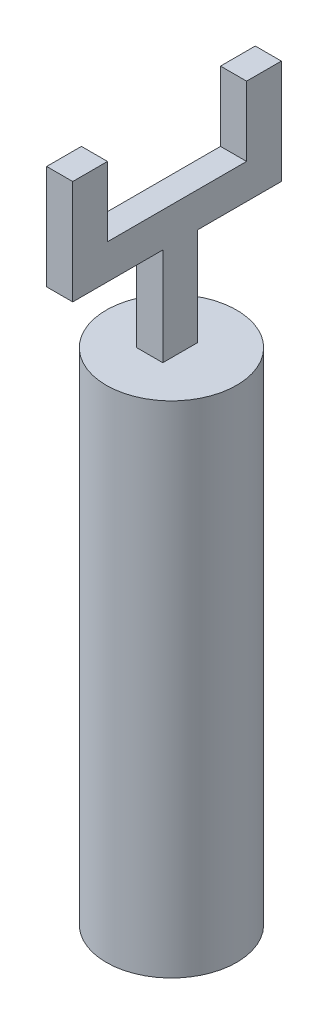
ISO-10303-21;
HEADER;
FILE_DESCRIPTION(('STEP AP214'),'2;1');
FILE_NAME('part.step','',(''),(''),'','','');
FILE_SCHEMA(('AUTOMOTIVE_DESIGN { 1 0 10303 214 1 1 1 1 }'));
ENDSEC;
DATA;
#1=APPLICATION_CONTEXT('core data for automotive mechanical design processes');
#2=APPLICATION_PROTOCOL_DEFINITION('international standard','automotive_design',2000,#1);
#3=PRODUCT_CONTEXT('',#1,'mechanical');
#4=PRODUCT('Part','Part','',(#3));
#5=PRODUCT_RELATED_PRODUCT_CATEGORY('part','',(#4));
#6=PRODUCT_DEFINITION_FORMATION('','',#4);
#7=PRODUCT_DEFINITION_CONTEXT('part definition',#1,'design');
#8=PRODUCT_DEFINITION('design','',#6,#7);
#9=PRODUCT_DEFINITION_SHAPE('','',#8);
#10=(LENGTH_UNIT() NAMED_UNIT(*) SI_UNIT(.MILLI.,.METRE.));
#11=(NAMED_UNIT(*) PLANE_ANGLE_UNIT() SI_UNIT($,.RADIAN.));
#12=(NAMED_UNIT(*) SI_UNIT($,.STERADIAN.) SOLID_ANGLE_UNIT());
#13=UNCERTAINTY_MEASURE_WITH_UNIT(LENGTH_MEASURE(1.E-05),#10,'distance_accuracy_value','');
#14=(GEOMETRIC_REPRESENTATION_CONTEXT(3) GLOBAL_UNCERTAINTY_ASSIGNED_CONTEXT((#13)) GLOBAL_UNIT_ASSIGNED_CONTEXT((#10,
#11,#12)) REPRESENTATION_CONTEXT('',''));
#15=CARTESIAN_POINT('',(0.,0.,0.));
#16=DIRECTION('',(0.,0.,1.));
#17=DIRECTION('',(1.,0.,0.));
#18=AXIS2_PLACEMENT_3D('',#15,#16,#17);
#19=CARTESIAN_POINT('',(0.1,6.87337780073219,1.23598294434797));
#20=DIRECTION('',(0.,1.,0.));
#21=DIRECTION('',(0.,0.,1.));
#22=AXIS2_PLACEMENT_3D('',#19,#20,#21);
#23=PLANE('',#22);
#24=DIRECTION('',(0.,0.,-1.));
#25=VECTOR('',#24,1.);
#26=CARTESIAN_POINT('',(-0.2,6.87337780073219,1.23598294434797));
#27=LINE('',#26,#25);
#28=CARTESIAN_POINT('',(-0.2,6.87337780073219,1.23598294434797));
#29=VERTEX_POINT('',#28);
#30=CARTESIAN_POINT('',(-0.2,6.87337780073219,0.2));
#31=VERTEX_POINT('',#30);
#32=EDGE_CURVE('E242',#29,#31,#27,.T.);
#33=ORIENTED_EDGE('',*,*,#32,.T.);
#34=DIRECTION('',(1.,0.,0.));
#35=VECTOR('',#34,1.);
#36=CARTESIAN_POINT('',(-0.2,6.87337780073219,0.2));
#37=LINE('',#36,#35);
#38=CARTESIAN_POINT('',(0.1,6.87337780073219,0.2));
#39=VERTEX_POINT('',#38);
#40=EDGE_CURVE('E13',#31,#39,#37,.T.);
#41=ORIENTED_EDGE('',*,*,#40,.T.);
#42=DIRECTION('',(0.,0.,-1.));
#43=VECTOR('',#42,1.);
#44=CARTESIAN_POINT('',(0.1,6.87337780073219,1.23598294434797));
#45=LINE('',#44,#43);
#46=CARTESIAN_POINT('',(0.1,6.87337780073219,1.23598294434797));
#47=VERTEX_POINT('',#46);
#48=EDGE_CURVE('E263',#47,#39,#45,.T.);
#49=ORIENTED_EDGE('',*,*,#48,.F.);
#50=DIRECTION('',(-1.,0.,0.));
#51=VECTOR('',#50,1.);
#52=CARTESIAN_POINT('',(0.1,6.87337780073219,1.23598294434797));
#53=LINE('',#52,#51);
#54=EDGE_CURVE('E282',#47,#29,#53,.T.);
#55=ORIENTED_EDGE('',*,*,#54,.T.);
#56=EDGE_LOOP('',(#33,#41,#49,#55));
#57=FACE_BOUND('',#56,.T.);
#58=ADVANCED_FACE('F119',(#57),#23,.F.);
#59=CARTESIAN_POINT('',(0.1,0.,0.));
#60=DIRECTION('',(1.,0.,0.));
#61=DIRECTION('',(0.,0.,-1.));
#62=AXIS2_PLACEMENT_3D('',#59,#60,#61);
#63=PLANE('',#62);
#64=DIRECTION('',(0.,1.,0.));
#65=VECTOR('',#64,1.);
#66=CARTESIAN_POINT('',(0.1,0.,0.2));
#67=LINE('',#66,#65);
#68=CARTESIAN_POINT('',(0.1,5.69193779464038,0.2));
#69=VERTEX_POINT('',#68);
#70=EDGE_CURVE('E221',#69,#39,#67,.T.);
#71=ORIENTED_EDGE('',*,*,#70,.F.);
#72=DIRECTION('',(0.,0.,-1.));
#73=VECTOR('',#72,1.);
#74=CARTESIAN_POINT('',(0.1,5.69193779464038,0.));
#75=LINE('',#74,#73);
#76=CARTESIAN_POINT('',(0.1,5.69193779464038,-0.2));
#77=VERTEX_POINT('',#76);
#78=EDGE_CURVE('E289',#69,#77,#75,.T.);
#79=ORIENTED_EDGE('',*,*,#78,.T.);
#80=DIRECTION('',(0.,1.,0.));
#81=VECTOR('',#80,1.);
#82=CARTESIAN_POINT('',(0.1,0.,-0.2));
#83=LINE('',#82,#81);
#84=CARTESIAN_POINT('',(0.1,6.87337780073219,-0.2));
#85=VERTEX_POINT('',#84);
#86=EDGE_CURVE('E292',#77,#85,#83,.T.);
#87=ORIENTED_EDGE('',*,*,#86,.T.);
#88=CARTESIAN_POINT('',(0.1,6.87337780073219,-1.16401705565203));
#89=VERTEX_POINT('',#88);
#90=EDGE_CURVE('E262',#85,#89,#45,.T.);
#91=ORIENTED_EDGE('',*,*,#90,.T.);
#92=DIRECTION('',(0.,1.,0.));
#93=VECTOR('',#92,1.);
#94=CARTESIAN_POINT('',(0.1,6.87337780073219,-1.16401705565203));
#95=LINE('',#94,#93);
#96=CARTESIAN_POINT('',(0.1,8.07337780073219,-1.16401705565203));
#97=VERTEX_POINT('',#96);
#98=EDGE_CURVE('E266',#89,#97,#95,.T.);
#99=ORIENTED_EDGE('',*,*,#98,.T.);
#100=DIRECTION('',(0.,0.,-1.));
#101=VECTOR('',#100,1.);
#102=CARTESIAN_POINT('',(0.1,8.07337780073219,-0.764017055652027));
#103=LINE('',#102,#101);
#104=CARTESIAN_POINT('',(0.1,8.07337780073219,-0.764017055652027));
#105=VERTEX_POINT('',#104);
#106=EDGE_CURVE('E268',#105,#97,#103,.T.);
#107=ORIENTED_EDGE('',*,*,#106,.F.);
#108=DIRECTION('',(0.,1.,0.));
#109=VECTOR('',#108,1.);
#110=CARTESIAN_POINT('',(0.1,7.27337780073219,-0.764017055652027));
#111=LINE('',#110,#109);
#112=CARTESIAN_POINT('',(0.1,7.27337780073219,-0.764017055652027));
#113=VERTEX_POINT('',#112);
#114=EDGE_CURVE('E271',#113,#105,#111,.T.);
#115=ORIENTED_EDGE('',*,*,#114,.F.);
#116=DIRECTION('',(0.,0.,1.));
#117=VECTOR('',#116,1.);
#118=CARTESIAN_POINT('',(0.1,7.27337780073219,-0.764017055652027));
#119=LINE('',#118,#117);
#120=CARTESIAN_POINT('',(0.1,7.27337780073219,0.835982944347973));
#121=VERTEX_POINT('',#120);
#122=EDGE_CURVE('E253',#113,#121,#119,.T.);
#123=ORIENTED_EDGE('',*,*,#122,.T.);
#124=DIRECTION('',(0.,1.,0.));
#125=VECTOR('',#124,1.);
#126=CARTESIAN_POINT('',(0.1,7.27337780073219,0.835982944347973));
#127=LINE('',#126,#125);
#128=CARTESIAN_POINT('',(0.1,8.07337780073219,0.835982944347973));
#129=VERTEX_POINT('',#128);
#130=EDGE_CURVE('E216',#121,#129,#127,.T.);
#131=ORIENTED_EDGE('',*,*,#130,.T.);
#132=DIRECTION('',(0.,0.,-1.));
#133=VECTOR('',#132,1.);
#134=CARTESIAN_POINT('',(0.1,8.07337780073219,1.23598294434797));
#135=LINE('',#134,#133);
#136=CARTESIAN_POINT('',(0.1,8.07337780073219,1.23598294434797));
#137=VERTEX_POINT('',#136);
#138=EDGE_CURVE('E256',#137,#129,#135,.T.);
#139=ORIENTED_EDGE('',*,*,#138,.F.);
#140=DIRECTION('',(0.,1.,0.));
#141=VECTOR('',#140,1.);
#142=CARTESIAN_POINT('',(0.1,6.87337780073219,1.23598294434797));
#143=LINE('',#142,#141);
#144=EDGE_CURVE('E259',#47,#137,#143,.T.);
#145=ORIENTED_EDGE('',*,*,#144,.F.);
#146=ORIENTED_EDGE('',*,*,#48,.T.);
#147=EDGE_LOOP('',(#71,#79,#87,#91,#99,#107,#115,#123,#131,#139,#145,#146));
#148=FACE_BOUND('',#147,.T.);
#149=ADVANCED_FACE('F308',(#148),#63,.T.);
#150=CARTESIAN_POINT('',(0.1,7.27337780073219,-0.764017055652027));
#151=DIRECTION('',(0.,-1.,0.));
#152=DIRECTION('',(0.,0.,-1.));
#153=AXIS2_PLACEMENT_3D('',#150,#151,#152);
#154=PLANE('',#153);
#155=DIRECTION('',(-1.,0.,0.));
#156=VECTOR('',#155,1.);
#157=CARTESIAN_POINT('',(0.1,7.27337780073219,-0.764017055652027));
#158=LINE('',#157,#156);
#159=CARTESIAN_POINT('',(-0.2,7.27337780073219,-0.764017055652027));
#160=VERTEX_POINT('',#159);
#161=EDGE_CURVE('E234',#113,#160,#158,.T.);
#162=ORIENTED_EDGE('',*,*,#161,.T.);
#163=DIRECTION('',(0.,0.,1.));
#164=VECTOR('',#163,1.);
#165=CARTESIAN_POINT('',(-0.2,7.27337780073219,-0.764017055652027));
#166=LINE('',#165,#164);
#167=CARTESIAN_POINT('',(-0.2,7.27337780073219,0.835982944347973));
#168=VERTEX_POINT('',#167);
#169=EDGE_CURVE('E228',#160,#168,#166,.T.);
#170=ORIENTED_EDGE('',*,*,#169,.T.);
#171=DIRECTION('',(-1.,0.,0.));
#172=VECTOR('',#171,1.);
#173=CARTESIAN_POINT('',(0.1,7.27337780073219,0.835982944347973));
#174=LINE('',#173,#172);
#175=EDGE_CURVE('E211',#121,#168,#174,.T.);
#176=ORIENTED_EDGE('',*,*,#175,.F.);
#177=ORIENTED_EDGE('',*,*,#122,.F.);
#178=EDGE_LOOP('',(#162,#170,#176,#177));
#179=FACE_BOUND('',#178,.T.);
#180=ADVANCED_FACE('F233',(#179),#154,.F.);
#181=CARTESIAN_POINT('',(0.1,7.27337780073219,0.835982944347973));
#182=DIRECTION('',(0.,0.,1.));
#183=DIRECTION('',(0.,-1.,0.));
#184=AXIS2_PLACEMENT_3D('',#181,#182,#183);
#185=PLANE('',#184);
#186=ORIENTED_EDGE('',*,*,#175,.T.);
#187=DIRECTION('',(0.,1.,0.));
#188=VECTOR('',#187,1.);
#189=CARTESIAN_POINT('',(-0.2,7.27337780073219,0.835982944347973));
#190=LINE('',#189,#188);
#191=CARTESIAN_POINT('',(-0.2,8.07337780073219,0.835982944347973));
#192=VERTEX_POINT('',#191);
#193=EDGE_CURVE('E215',#168,#192,#190,.T.);
#194=ORIENTED_EDGE('',*,*,#193,.T.);
#195=DIRECTION('',(-1.,0.,0.));
#196=VECTOR('',#195,1.);
#197=CARTESIAN_POINT('',(0.1,8.07337780073219,0.835982944347973));
#198=LINE('',#197,#196);
#199=EDGE_CURVE('E222',#129,#192,#198,.T.);
#200=ORIENTED_EDGE('',*,*,#199,.F.);
#201=ORIENTED_EDGE('',*,*,#130,.F.);
#202=EDGE_LOOP('',(#186,#194,#200,#201));
#203=FACE_BOUND('',#202,.T.);
#204=ADVANCED_FACE('F213',(#203),#185,.F.);
#205=CARTESIAN_POINT('',(0.1,8.07337780073219,1.23598294434797));
#206=DIRECTION('',(0.,1.,0.));
#207=DIRECTION('',(0.,0.,1.));
#208=AXIS2_PLACEMENT_3D('',#205,#206,#207);
#209=PLANE('',#208);
#210=ORIENTED_EDGE('',*,*,#199,.T.);
#211=DIRECTION('',(0.,0.,-1.));
#212=VECTOR('',#211,1.);
#213=CARTESIAN_POINT('',(-0.2,8.07337780073219,1.23598294434797));
#214=LINE('',#213,#212);
#215=CARTESIAN_POINT('',(-0.2,8.07337780073219,1.23598294434797));
#216=VERTEX_POINT('',#215);
#217=EDGE_CURVE('E231',#216,#192,#214,.T.);
#218=ORIENTED_EDGE('',*,*,#217,.F.);
#219=DIRECTION('',(-1.,0.,0.));
#220=VECTOR('',#219,1.);
#221=CARTESIAN_POINT('',(0.1,8.07337780073219,1.23598294434797));
#222=LINE('',#221,#220);
#223=EDGE_CURVE('E284',#137,#216,#222,.T.);
#224=ORIENTED_EDGE('',*,*,#223,.F.);
#225=ORIENTED_EDGE('',*,*,#138,.T.);
#226=EDGE_LOOP('',(#210,#218,#224,#225));
#227=FACE_BOUND('',#226,.T.);
#228=ADVANCED_FACE('F316',(#227),#209,.T.);
#229=CARTESIAN_POINT('',(0.1,6.87337780073219,1.23598294434797));
#230=DIRECTION('',(0.,0.,1.));
#231=DIRECTION('',(1.,0.,0.));
#232=AXIS2_PLACEMENT_3D('',#229,#230,#231);
#233=PLANE('',#232);
#234=ORIENTED_EDGE('',*,*,#223,.T.);
#235=DIRECTION('',(0.,1.,0.));
#236=VECTOR('',#235,1.);
#237=CARTESIAN_POINT('',(-0.2,6.87337780073219,1.23598294434797));
#238=LINE('',#237,#236);
#239=EDGE_CURVE('E239',#29,#216,#238,.T.);
#240=ORIENTED_EDGE('',*,*,#239,.F.);
#241=ORIENTED_EDGE('',*,*,#54,.F.);
#242=ORIENTED_EDGE('',*,*,#144,.T.);
#243=EDGE_LOOP('',(#234,#240,#241,#242));
#244=FACE_BOUND('',#243,.T.);
#245=ADVANCED_FACE('F317',(#244),#233,.T.);
#246=DIRECTION('',(1.,0.,0.));
#247=VECTOR('',#246,1.);
#248=CARTESIAN_POINT('',(-0.2,6.87337780073219,-0.2));
#249=LINE('',#248,#247);
#250=CARTESIAN_POINT('',(-0.2,6.87337780073219,-0.2));
#251=VERTEX_POINT('',#250);
#252=EDGE_CURVE('E128',#251,#85,#249,.T.);
#253=ORIENTED_EDGE('',*,*,#252,.F.);
#254=CARTESIAN_POINT('',(-0.2,6.87337780073219,-1.16401705565203));
#255=VERTEX_POINT('',#254);
#256=EDGE_CURVE('E241',#251,#255,#27,.T.);
#257=ORIENTED_EDGE('',*,*,#256,.T.);
#258=DIRECTION('',(-1.,0.,0.));
#259=VECTOR('',#258,1.);
#260=CARTESIAN_POINT('',(0.1,6.87337780073219,-1.16401705565203));
#261=LINE('',#260,#259);
#262=EDGE_CURVE('E279',#89,#255,#261,.T.);
#263=ORIENTED_EDGE('',*,*,#262,.F.);
#264=ORIENTED_EDGE('',*,*,#90,.F.);
#265=EDGE_LOOP('',(#253,#257,#263,#264));
#266=FACE_BOUND('',#265,.T.);
#267=ADVANCED_FACE('F319',(#266),#23,.F.);
#268=CARTESIAN_POINT('',(0.1,6.87337780073219,-1.16401705565203));
#269=DIRECTION('',(0.,0.,1.));
#270=DIRECTION('',(1.,0.,0.));
#271=AXIS2_PLACEMENT_3D('',#268,#269,#270);
#272=PLANE('',#271);
#273=ORIENTED_EDGE('',*,*,#262,.T.);
#274=DIRECTION('',(0.,1.,0.));
#275=VECTOR('',#274,1.);
#276=CARTESIAN_POINT('',(-0.2,6.87337780073219,-1.16401705565203));
#277=LINE('',#276,#275);
#278=CARTESIAN_POINT('',(-0.2,8.07337780073219,-1.16401705565203));
#279=VERTEX_POINT('',#278);
#280=EDGE_CURVE('E245',#255,#279,#277,.T.);
#281=ORIENTED_EDGE('',*,*,#280,.T.);
#282=DIRECTION('',(-1.,0.,0.));
#283=VECTOR('',#282,1.);
#284=CARTESIAN_POINT('',(0.1,8.07337780073219,-1.16401705565203));
#285=LINE('',#284,#283);
#286=EDGE_CURVE('E277',#97,#279,#285,.T.);
#287=ORIENTED_EDGE('',*,*,#286,.F.);
#288=ORIENTED_EDGE('',*,*,#98,.F.);
#289=EDGE_LOOP('',(#273,#281,#287,#288));
#290=FACE_BOUND('',#289,.T.);
#291=ADVANCED_FACE('F325',(#290),#272,.F.);
#292=CARTESIAN_POINT('',(0.1,8.07337780073219,-0.764017055652027));
#293=DIRECTION('',(0.,1.,0.));
#294=DIRECTION('',(0.,0.,1.));
#295=AXIS2_PLACEMENT_3D('',#292,#293,#294);
#296=PLANE('',#295);
#297=ORIENTED_EDGE('',*,*,#286,.T.);
#298=DIRECTION('',(0.,0.,-1.));
#299=VECTOR('',#298,1.);
#300=CARTESIAN_POINT('',(-0.2,8.07337780073219,-0.764017055652027));
#301=LINE('',#300,#299);
#302=CARTESIAN_POINT('',(-0.2,8.07337780073219,-0.764017055652027));
#303=VERTEX_POINT('',#302);
#304=EDGE_CURVE('E248',#303,#279,#301,.T.);
#305=ORIENTED_EDGE('',*,*,#304,.F.);
#306=DIRECTION('',(-1.,0.,0.));
#307=VECTOR('',#306,1.);
#308=CARTESIAN_POINT('',(0.1,8.07337780073219,-0.764017055652027));
#309=LINE('',#308,#307);
#310=EDGE_CURVE('E275',#105,#303,#309,.T.);
#311=ORIENTED_EDGE('',*,*,#310,.F.);
#312=ORIENTED_EDGE('',*,*,#106,.T.);
#313=EDGE_LOOP('',(#297,#305,#311,#312));
#314=FACE_BOUND('',#313,.T.);
#315=ADVANCED_FACE('F337',(#314),#296,.T.);
#316=CARTESIAN_POINT('',(0.1,7.27337780073219,-0.764017055652027));
#317=DIRECTION('',(0.,0.,1.));
#318=DIRECTION('',(1.,0.,0.));
#319=AXIS2_PLACEMENT_3D('',#316,#317,#318);
#320=PLANE('',#319);
#321=ORIENTED_EDGE('',*,*,#310,.T.);
#322=DIRECTION('',(0.,1.,0.));
#323=VECTOR('',#322,1.);
#324=CARTESIAN_POINT('',(-0.2,7.27337780073219,-0.764017055652027));
#325=LINE('',#324,#323);
#326=EDGE_CURVE('E251',#160,#303,#325,.T.);
#327=ORIENTED_EDGE('',*,*,#326,.F.);
#328=ORIENTED_EDGE('',*,*,#161,.F.);
#329=ORIENTED_EDGE('',*,*,#114,.T.);
#330=EDGE_LOOP('',(#321,#327,#328,#329));
#331=FACE_BOUND('',#330,.T.);
#332=ADVANCED_FACE('F341',(#331),#320,.T.);
#333=CARTESIAN_POINT('',(-0.2,0.,0.2));
#334=DIRECTION('',(0.,0.,-1.));
#335=DIRECTION('',(0.,1.,0.));
#336=AXIS2_PLACEMENT_3D('',#333,#334,#335);
#337=PLANE('',#336);
#338=DIRECTION('',(1.,0.,0.));
#339=VECTOR('',#338,1.);
#340=CARTESIAN_POINT('',(-0.2,5.69193779464038,0.2));
#341=LINE('',#340,#339);
#342=CARTESIAN_POINT('',(-0.2,5.69193779464038,0.2));
#343=VERTEX_POINT('',#342);
#344=EDGE_CURVE('E123',#343,#69,#341,.T.);
#345=ORIENTED_EDGE('',*,*,#344,.T.);
#346=ORIENTED_EDGE('',*,*,#70,.T.);
#347=ORIENTED_EDGE('',*,*,#40,.F.);
#348=DIRECTION('',(0.,1.,0.));
#349=VECTOR('',#348,1.);
#350=CARTESIAN_POINT('',(-0.2,0.,0.2));
#351=LINE('',#350,#349);
#352=EDGE_CURVE('E136',#343,#31,#351,.T.);
#353=ORIENTED_EDGE('',*,*,#352,.F.);
#354=EDGE_LOOP('',(#345,#346,#347,#353));
#355=FACE_BOUND('',#354,.T.);
#356=ADVANCED_FACE('F121',(#355),#337,.F.);
#357=CARTESIAN_POINT('',(-0.2,0.,-0.2));
#358=DIRECTION('',(0.,0.,-1.));
#359=DIRECTION('',(0.,1.,0.));
#360=AXIS2_PLACEMENT_3D('',#357,#358,#359);
#361=PLANE('',#360);
#362=ORIENTED_EDGE('',*,*,#252,.T.);
#363=ORIENTED_EDGE('',*,*,#86,.F.);
#364=DIRECTION('',(1.,0.,0.));
#365=VECTOR('',#364,1.);
#366=CARTESIAN_POINT('',(-0.2,5.69193779464038,-0.2));
#367=LINE('',#366,#365);
#368=CARTESIAN_POINT('',(-0.2,5.69193779464038,-0.2));
#369=VERTEX_POINT('',#368);
#370=EDGE_CURVE('E300',#369,#77,#367,.T.);
#371=ORIENTED_EDGE('',*,*,#370,.F.);
#372=DIRECTION('',(0.,1.,0.));
#373=VECTOR('',#372,1.);
#374=CARTESIAN_POINT('',(-0.2,0.,-0.2));
#375=LINE('',#374,#373);
#376=EDGE_CURVE('E144',#369,#251,#375,.T.);
#377=ORIENTED_EDGE('',*,*,#376,.T.);
#378=EDGE_LOOP('',(#362,#363,#371,#377));
#379=FACE_BOUND('',#378,.T.);
#380=ADVANCED_FACE('F348',(#379),#361,.T.);
#381=CARTESIAN_POINT('',(-0.2,5.69193779464038,0.));
#382=DIRECTION('',(0.,-1.,0.));
#383=DIRECTION('',(0.,0.,-1.));
#384=AXIS2_PLACEMENT_3D('',#381,#382,#383);
#385=PLANE('',#384);
#386=ORIENTED_EDGE('',*,*,#370,.T.);
#387=ORIENTED_EDGE('',*,*,#78,.F.);
#388=ORIENTED_EDGE('',*,*,#344,.F.);
#389=DIRECTION('',(0.,0.,-1.));
#390=VECTOR('',#389,1.);
#391=CARTESIAN_POINT('',(-0.2,5.69193779464038,0.));
#392=LINE('',#391,#390);
#393=EDGE_CURVE('E296',#343,#369,#392,.T.);
#394=ORIENTED_EDGE('',*,*,#393,.T.);
#395=EDGE_LOOP('',(#386,#387,#388,#394));
#396=FACE_BOUND('',#395,.T.);
#397=ADVANCED_FACE('F305',(#396),#385,.T.);
#398=CARTESIAN_POINT('',(-0.2,0.,0.));
#399=DIRECTION('',(1.,0.,0.));
#400=DIRECTION('',(0.,0.,-1.));
#401=AXIS2_PLACEMENT_3D('',#398,#399,#400);
#402=PLANE('',#401);
#403=ORIENTED_EDGE('',*,*,#352,.T.);
#404=ORIENTED_EDGE('',*,*,#32,.F.);
#405=ORIENTED_EDGE('',*,*,#239,.T.);
#406=ORIENTED_EDGE('',*,*,#217,.T.);
#407=ORIENTED_EDGE('',*,*,#193,.F.);
#408=ORIENTED_EDGE('',*,*,#169,.F.);
#409=ORIENTED_EDGE('',*,*,#326,.T.);
#410=ORIENTED_EDGE('',*,*,#304,.T.);
#411=ORIENTED_EDGE('',*,*,#280,.F.);
#412=ORIENTED_EDGE('',*,*,#256,.F.);
#413=ORIENTED_EDGE('',*,*,#376,.F.);
#414=ORIENTED_EDGE('',*,*,#393,.F.);
#415=EDGE_LOOP('',(#403,#404,#405,#406,#407,#408,#409,#410,#411,#412,#413,#414));
#416=FACE_BOUND('',#415,.T.);
#417=ADVANCED_FACE('F226',(#416),#402,.F.);
#418=CLOSED_SHELL('',(#58,#149,#180,#204,#228,#245,#267,#291,#315,#332,#356,#380,#397,#417));
#419=MANIFOLD_SOLID_BREP('B2',#418);
#420=CARTESIAN_POINT('',(0.,5.75,0.));
#421=DIRECTION('',(0.,-1.,0.));
#422=DIRECTION('',(0.,0.,-1.));
#423=AXIS2_PLACEMENT_3D('',#420,#421,#422);
#424=CYLINDRICAL_SURFACE('',#423,0.75);
#425=CARTESIAN_POINT('',(0.,5.75,0.));
#426=DIRECTION('',(0.,1.,0.));
#427=DIRECTION('',(0.,0.,1.));
#428=AXIS2_PLACEMENT_3D('',#425,#426,#427);
#429=CIRCLE('',#428,0.75);
#430=CARTESIAN_POINT('',(0.,5.75,0.75));
#431=VERTEX_POINT('',#430);
#432=EDGE_CURVE('E118',#431,#431,#429,.T.);
#433=ORIENTED_EDGE('',*,*,#432,.F.);
#434=EDGE_LOOP('',(#433));
#435=FACE_BOUND('',#434,.T.);
#436=CARTESIAN_POINT('',(0.,0.,0.));
#437=DIRECTION('',(0.,1.,0.));
#438=DIRECTION('',(0.,0.,1.));
#439=AXIS2_PLACEMENT_3D('',#436,#437,#438);
#440=CIRCLE('',#439,0.75);
#441=CARTESIAN_POINT('',(0.,0.,0.75));
#442=VERTEX_POINT('',#441);
#443=EDGE_CURVE('E457',#442,#442,#440,.T.);
#444=ORIENTED_EDGE('',*,*,#443,.T.);
#445=EDGE_LOOP('',(#444));
#446=FACE_BOUND('',#445,.T.);
#447=ADVANCED_FACE('F454',(#435,#446),#424,.T.);
#448=CARTESIAN_POINT('',(0.,5.75,0.));
#449=DIRECTION('',(0.,1.,0.));
#450=DIRECTION('',(0.,0.,1.));
#451=AXIS2_PLACEMENT_3D('',#448,#449,#450);
#452=PLANE('',#451);
#453=ORIENTED_EDGE('',*,*,#432,.T.);
#454=EDGE_LOOP('',(#453));
#455=FACE_BOUND('',#454,.T.);
#456=ADVANCED_FACE('F469',(#455),#452,.T.);
#457=CARTESIAN_POINT('',(0.,0.,0.));
#458=DIRECTION('',(0.,1.,0.));
#459=DIRECTION('',(0.,0.,1.));
#460=AXIS2_PLACEMENT_3D('',#457,#458,#459);
#461=PLANE('',#460);
#462=ORIENTED_EDGE('',*,*,#443,.F.);
#463=EDGE_LOOP('',(#462));
#464=FACE_BOUND('',#463,.T.);
#465=ADVANCED_FACE('F467',(#464),#461,.F.);
#466=CLOSED_SHELL('',(#447,#456,#465));
#467=MANIFOLD_SOLID_BREP('B7',#466);
#468=ADVANCED_BREP_SHAPE_REPRESENTATION('',(#18,#419,#467),#14);
#469=SHAPE_DEFINITION_REPRESENTATION(#9,#468);
ENDSEC;
END-ISO-10303-21;
